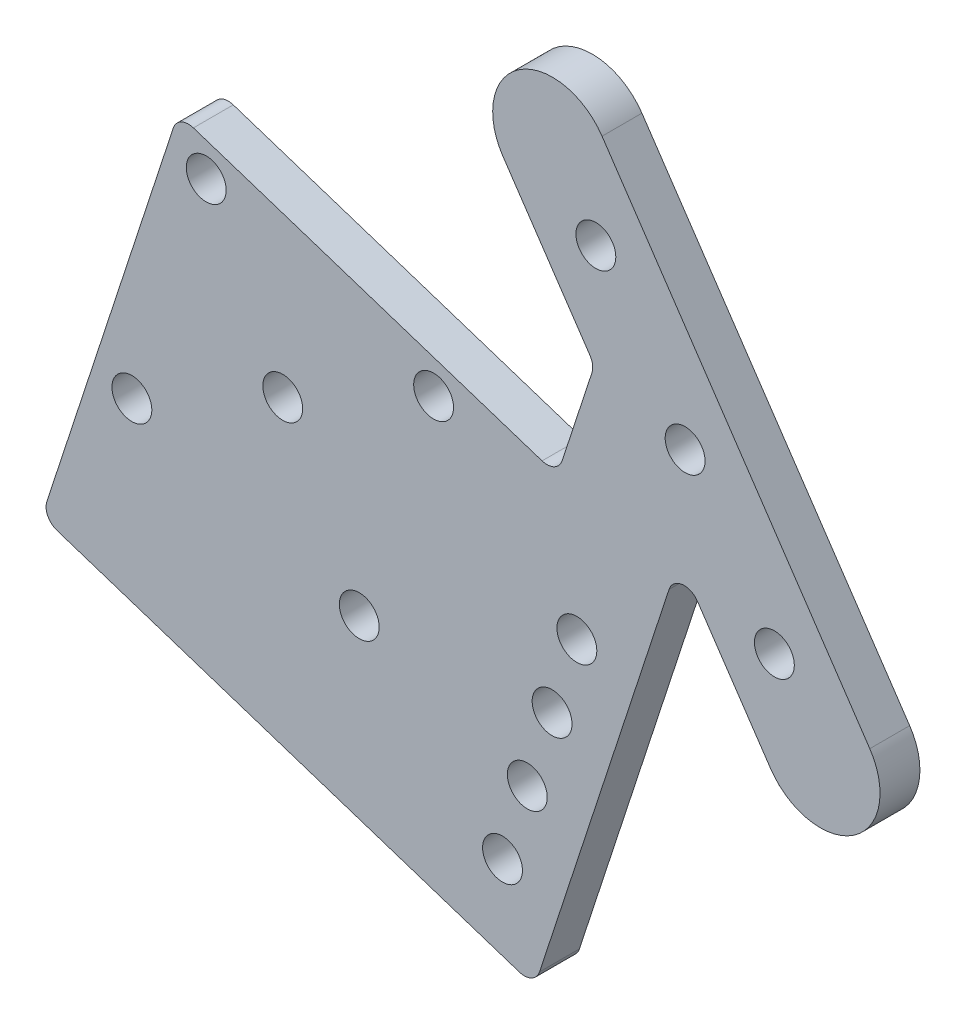
ISO-10303-21;
HEADER;
FILE_DESCRIPTION(('STEP AP214'),'2;1');
FILE_NAME('part.step','',(''),(''),'','','');
FILE_SCHEMA(('AUTOMOTIVE_DESIGN { 1 0 10303 214 1 1 1 1 }'));
ENDSEC;
DATA;
#1=APPLICATION_CONTEXT('core data for automotive mechanical design processes');
#2=APPLICATION_PROTOCOL_DEFINITION('international standard','automotive_design',2000,#1);
#3=PRODUCT_CONTEXT('',#1,'mechanical');
#4=PRODUCT('Part','Part','',(#3));
#5=PRODUCT_RELATED_PRODUCT_CATEGORY('part','',(#4));
#6=PRODUCT_DEFINITION_FORMATION('','',#4);
#7=PRODUCT_DEFINITION_CONTEXT('part definition',#1,'design');
#8=PRODUCT_DEFINITION('design','',#6,#7);
#9=PRODUCT_DEFINITION_SHAPE('','',#8);
#10=(LENGTH_UNIT() NAMED_UNIT(*) SI_UNIT(.MILLI.,.METRE.));
#11=(NAMED_UNIT(*) PLANE_ANGLE_UNIT() SI_UNIT($,.RADIAN.));
#12=(NAMED_UNIT(*) SI_UNIT($,.STERADIAN.) SOLID_ANGLE_UNIT());
#13=UNCERTAINTY_MEASURE_WITH_UNIT(LENGTH_MEASURE(1.E-05),#10,'distance_accuracy_value','');
#14=(GEOMETRIC_REPRESENTATION_CONTEXT(3) GLOBAL_UNCERTAINTY_ASSIGNED_CONTEXT((#13)) GLOBAL_UNIT_ASSIGNED_CONTEXT((#10,
#11,#12)) REPRESENTATION_CONTEXT('',''));
#15=CARTESIAN_POINT('',(0.,0.,0.));
#16=DIRECTION('',(0.,0.,1.));
#17=DIRECTION('',(1.,0.,0.));
#18=AXIS2_PLACEMENT_3D('',#15,#16,#17);
#19=CARTESIAN_POINT('',(-21.1234499247793,31.2849399165607,6.35));
#20=DIRECTION('',(0.,0.,1.));
#21=DIRECTION('',(1.,0.,0.));
#22=AXIS2_PLACEMENT_3D('',#19,#20,#21);
#23=PLANE('',#22);
#24=CARTESIAN_POINT('',(-76.2681819782983,-0.792959836781642,6.35));
#25=DIRECTION('',(0.,0.,-1.));
#26=DIRECTION('',(-1.,0.,0.));
#27=AXIS2_PLACEMENT_3D('',#24,#25,#26);
#28=CIRCLE('',#27,3.175);
#29=CARTESIAN_POINT('',(-79.4431819782983,-0.792959836781642,6.35));
#30=VERTEX_POINT('',#29);
#31=EDGE_CURVE('E266',#30,#30,#28,.T.);
#32=ORIENTED_EDGE('',*,*,#31,.T.);
#33=EDGE_LOOP('',(#32));
#34=FACE_BOUND('',#33,.T.);
#35=CARTESIAN_POINT('',(-40.0554564522475,-12.6356162100328,6.35));
#36=DIRECTION('',(0.,0.,-1.));
#37=DIRECTION('',(-1.,0.,0.));
#38=AXIS2_PLACEMENT_3D('',#35,#36,#37);
#39=CIRCLE('',#38,3.175);
#40=CARTESIAN_POINT('',(-43.2304564522475,-12.6356162100328,6.35));
#41=VERTEX_POINT('',#40);
#42=EDGE_CURVE('E652',#41,#41,#39,.T.);
#43=ORIENTED_EDGE('',*,*,#42,.T.);
#44=EDGE_LOOP('',(#43));
#45=FACE_BOUND('',#44,.T.);
#46=CARTESIAN_POINT('',(-51.8981128254986,-48.8483417360836,6.35));
#47=DIRECTION('',(0.,0.,-1.));
#48=DIRECTION('',(-1.,0.,0.));
#49=AXIS2_PLACEMENT_3D('',#46,#47,#48);
#50=CIRCLE('',#49,3.175);
#51=CARTESIAN_POINT('',(-55.0731128254986,-48.8483417360836,6.35));
#52=VERTEX_POINT('',#51);
#53=EDGE_CURVE('E657',#52,#52,#50,.T.);
#54=ORIENTED_EDGE('',*,*,#53,.T.);
#55=EDGE_LOOP('',(#54));
#56=FACE_BOUND('',#55,.T.);
#57=CARTESIAN_POINT('',(-88.1108383515494,-37.0056853628325,6.35));
#58=DIRECTION('',(0.,0.,-1.));
#59=DIRECTION('',(-1.,0.,0.));
#60=AXIS2_PLACEMENT_3D('',#57,#58,#59);
#61=CIRCLE('',#60,3.175);
#62=CARTESIAN_POINT('',(-91.2858383515494,-37.0056853628325,6.35));
#63=VERTEX_POINT('',#62);
#64=EDGE_CURVE('E668',#63,#63,#61,.T.);
#65=ORIENTED_EDGE('',*,*,#64,.T.);
#66=EDGE_LOOP('',(#65));
#67=FACE_BOUND('',#66,.T.);
#68=CARTESIAN_POINT('',(-64.0831474018985,-24.8206507864326,6.35));
#69=DIRECTION('',(0.,0.,-1.));
#70=DIRECTION('',(-1.,0.,0.));
#71=AXIS2_PLACEMENT_3D('',#68,#69,#70);
#72=CIRCLE('',#71,3.175);
#73=CARTESIAN_POINT('',(-67.2581474018985,-24.8206507864326,6.35));
#74=VERTEX_POINT('',#73);
#75=EDGE_CURVE('E673',#74,#74,#72,.T.);
#76=ORIENTED_EDGE('',*,*,#75,.T.);
#77=EDGE_LOOP('',(#76));
#78=FACE_BOUND('',#77,.T.);
#79=CARTESIAN_POINT('',(-21.1857717689851,-46.8665163582067,6.35));
#80=DIRECTION('',(0.,0.,1.));
#81=DIRECTION('',(1.,0.,0.));
#82=AXIS2_PLACEMENT_3D('',#79,#80,#81);
#83=CIRCLE('',#82,3.175);
#84=CARTESIAN_POINT('',(-18.0107717689851,-46.8665163582067,6.35));
#85=VERTEX_POINT('',#84);
#86=EDGE_CURVE('E274',#85,#85,#83,.T.);
#87=ORIENTED_EDGE('',*,*,#86,.F.);
#88=EDGE_LOOP('',(#87));
#89=FACE_BOUND('',#88,.T.);
#90=CARTESIAN_POINT('',(-25.1333238934022,-58.9374248668903,6.35));
#91=DIRECTION('',(0.,0.,1.));
#92=DIRECTION('',(1.,0.,0.));
#93=AXIS2_PLACEMENT_3D('',#90,#91,#92);
#94=CIRCLE('',#93,3.175);
#95=CARTESIAN_POINT('',(-21.9583238934022,-58.9374248668903,6.35));
#96=VERTEX_POINT('',#95);
#97=EDGE_CURVE('E286',#96,#96,#94,.T.);
#98=ORIENTED_EDGE('',*,*,#97,.F.);
#99=EDGE_LOOP('',(#98));
#100=FACE_BOUND('',#99,.T.);
#101=CARTESIAN_POINT('',(14.2134373211067,-21.0508479524928,6.35));
#102=DIRECTION('',(0.,0.,1.));
#103=DIRECTION('',(1.,0.,0.));
#104=AXIS2_PLACEMENT_3D('',#101,#102,#103);
#105=CIRCLE('',#104,3.17500000000001);
#106=CARTESIAN_POINT('',(17.3884373211067,-21.0508479524928,6.35));
#107=VERTEX_POINT('',#106);
#108=EDGE_CURVE('E298',#107,#107,#105,.T.);
#109=ORIENTED_EDGE('',*,*,#108,.F.);
#110=EDGE_LOOP('',(#109));
#111=FACE_BOUND('',#110,.T.);
#112=DIRECTION('',(0.950465236904222,-0.310830875938349,0.));
#113=VECTOR('',#112,1.);
#114=CARTESIAN_POINT('',(-23.9752467607235,-86.0399059775703,6.35));
#115=LINE('',#114,#113);
#116=CARTESIAN_POINT('',(-100.02197036543,-61.170327593743,6.35));
#117=VERTEX_POINT('',#116);
#118=CARTESIAN_POINT('',(-26.3894284624602,-85.2503955526869,6.35));
#119=VERTEX_POINT('',#118);
#120=EDGE_CURVE('E310',#117,#119,#115,.T.);
#121=ORIENTED_EDGE('',*,*,#120,.T.);
#122=CARTESIAN_POINT('',(-25.5999180375768,-82.8362138509502,6.35));
#123=DIRECTION('',(0.,0.,1.));
#124=DIRECTION('',(1.,0.,0.));
#125=AXIS2_PLACEMENT_3D('',#122,#123,#124);
#126=CIRCLE('',#125,2.54);
#127=CARTESIAN_POINT('',(-23.1857363358401,-83.6257242758336,6.35));
#128=VERTEX_POINT('',#127);
#129=EDGE_CURVE('E210',#119,#128,#126,.T.);
#130=ORIENTED_EDGE('',*,*,#129,.T.);
#131=DIRECTION('',(0.310830875938348,0.950465236904222,0.));
#132=VECTOR('',#131,1.);
#133=CARTESIAN_POINT('',(-0.945979197778359,-15.6205237850276,6.35));
#134=LINE('',#133,#132);
#135=CARTESIAN_POINT('',(-2.55983871036055,-20.5554175896599,6.35));
#136=VERTEX_POINT('',#135);
#137=EDGE_CURVE('E312',#128,#136,#134,.T.);
#138=ORIENTED_EDGE('',*,*,#137,.T.);
#139=CARTESIAN_POINT('',(-0.145657008623822,-21.3449280145433,6.35));
#140=DIRECTION('',(0.,0.,1.));
#141=DIRECTION('',(1.,0.,0.));
#142=AXIS2_PLACEMENT_3D('',#139,#140,#141);
#143=CIRCLE('',#142,2.54);
#144=CARTESIAN_POINT('',(1.95942778662546,-19.9235842824326,6.35));
#145=VERTEX_POINT('',#144);
#146=EDGE_CURVE('E227',#136,#145,#143,.F.);
#147=ORIENTED_EDGE('',*,*,#146,.T.);
#148=DIRECTION('',(0.559584146500264,-0.828773541436725,0.));
#149=VECTOR('',#148,1.);
#150=CARTESIAN_POINT('',(-0.945979197778359,-15.6205237850276,6.35));
#151=LINE('',#150,#149);
#152=CARTESIAN_POINT('',(13.622794056356,-37.1976429363328,6.35));
#153=VERTEX_POINT('',#152);
#154=EDGE_CURVE('E315',#145,#153,#151,.T.);
#155=ORIENTED_EDGE('',*,*,#154,.T.);
#156=CARTESIAN_POINT('',(21.5168620385408,-31.8676039409177,6.35));
#157=DIRECTION('',(0.,0.,1.));
#158=DIRECTION('',(1.,0.,0.));
#159=AXIS2_PLACEMENT_3D('',#156,#157,#158);
#160=CIRCLE('',#159,9.525);
#161=CARTESIAN_POINT('',(29.4109300207256,-26.5375649455027,6.35));
#162=VERTEX_POINT('',#161);
#163=EDGE_CURVE('E317',#153,#162,#160,.T.);
#164=ORIENTED_EDGE('',*,*,#163,.T.);
#165=DIRECTION('',(-0.559584146500264,0.828773541436725,0.));
#166=VECTOR('',#165,1.);
#167=CARTESIAN_POINT('',(-13.2293819425945,36.6149789119757,6.35));
#168=LINE('',#167,#166);
#169=CARTESIAN_POINT('',(-13.2293819425945,36.6149789119757,6.35));
#170=VERTEX_POINT('',#169);
#171=EDGE_CURVE('E166',#162,#170,#168,.T.);
#172=ORIENTED_EDGE('',*,*,#171,.T.);
#173=CARTESIAN_POINT('',(-21.1234499247793,31.2849399165607,6.35));
#174=DIRECTION('',(0.,0.,1.));
#175=DIRECTION('',(1.,0.,0.));
#176=AXIS2_PLACEMENT_3D('',#173,#174,#175);
#177=CIRCLE('',#176,9.52499999999999);
#178=CARTESIAN_POINT('',(-29.0175179069641,25.9549009211457,6.35));
#179=VERTEX_POINT('',#178);
#180=EDGE_CURVE('E160',#170,#179,#177,.T.);
#181=ORIENTED_EDGE('',*,*,#180,.T.);
#182=DIRECTION('',(0.559584146500264,-0.828773541436725,0.));
#183=VECTOR('',#182,1.);
#184=CARTESIAN_POINT('',(-29.0175179069641,25.9549009211457,6.35));
#185=LINE('',#184,#183);
#186=CARTESIAN_POINT('',(-15.1440751231063,5.4076027537338,6.35));
#187=VERTEX_POINT('',#186);
#188=EDGE_CURVE('E149',#179,#187,#185,.T.);
#189=ORIENTED_EDGE('',*,*,#188,.T.);
#190=CARTESIAN_POINT('',(-17.2491599183556,3.98625902162313,6.35));
#191=DIRECTION('',(0.,0.,1.));
#192=DIRECTION('',(1.,0.,0.));
#193=AXIS2_PLACEMENT_3D('',#190,#191,#192);
#194=CIRCLE('',#193,2.54);
#195=CARTESIAN_POINT('',(-14.8349782166188,3.19674859673972,6.35));
#196=VERTEX_POINT('',#195);
#197=EDGE_CURVE('E223',#187,#196,#194,.F.);
#198=ORIENTED_EDGE('',*,*,#197,.T.);
#199=DIRECTION('',(-0.310830875938349,-0.950465236904222,0.));
#200=VECTOR('',#199,1.);
#201=CARTESIAN_POINT('',(-14.4487446528297,4.37778176984056,6.35));
#202=LINE('',#201,#200);
#203=CARTESIAN_POINT('',(-19.5805624145718,-11.3143992914481,6.35));
#204=VERTEX_POINT('',#203);
#205=EDGE_CURVE('E159',#196,#204,#202,.T.);
#206=ORIENTED_EDGE('',*,*,#205,.T.);
#207=CARTESIAN_POINT('',(-21.9947441163086,-10.5248888665647,6.35));
#208=DIRECTION('',(0.,0.,1.));
#209=DIRECTION('',(1.,0.,0.));
#210=AXIS2_PLACEMENT_3D('',#207,#208,#209);
#211=CIRCLE('',#210,2.54);
#212=CARTESIAN_POINT('',(-22.784254541192,-12.9390705683014,6.35));
#213=VERTEX_POINT('',#212);
#214=EDGE_CURVE('E11',#204,#213,#211,.F.);
#215=ORIENTED_EDGE('',*,*,#214,.T.);
#216=DIRECTION('',(0.950465236904222,-0.310830875938349,0.));
#217=VECTOR('',#216,1.);
#218=CARTESIAN_POINT('',(-80.7246153828733,6.0091796289003,6.35));
#219=LINE('',#218,#217);
#220=CARTESIAN_POINT('',(-78.3104336811366,5.21966920401689,6.35));
#221=VERTEX_POINT('',#220);
#222=EDGE_CURVE('E251',#221,#213,#219,.T.);
#223=ORIENTED_EDGE('',*,*,#222,.F.);
#224=CARTESIAN_POINT('',(-79.09994410602,2.80548750228016,6.35));
#225=DIRECTION('',(0.,0.,1.));
#226=DIRECTION('',(1.,0.,0.));
#227=AXIS2_PLACEMENT_3D('',#224,#225,#226);
#228=CIRCLE('',#227,2.54);
#229=CARTESIAN_POINT('',(-81.5141258077568,3.59499792716355,6.35));
#230=VERTEX_POINT('',#229);
#231=EDGE_CURVE('E50',#221,#230,#228,.T.);
#232=ORIENTED_EDGE('',*,*,#231,.T.);
#233=DIRECTION('',(0.310830875938349,0.950465236904222,0.));
#234=VECTOR('',#233,1.);
#235=CARTESIAN_POINT('',(-102.436152067167,-60.3808171688596,6.35));
#236=LINE('',#235,#234);
#237=CARTESIAN_POINT('',(-101.646641642284,-57.9666354671229,6.35));
#238=VERTEX_POINT('',#237);
#239=EDGE_CURVE('E255',#238,#230,#236,.T.);
#240=ORIENTED_EDGE('',*,*,#239,.F.);
#241=CARTESIAN_POINT('',(-99.2324599405469,-58.7561458920063,6.35));
#242=DIRECTION('',(0.,0.,1.));
#243=DIRECTION('',(1.,0.,0.));
#244=AXIS2_PLACEMENT_3D('',#241,#242,#243);
#245=CIRCLE('',#244,2.54);
#246=EDGE_CURVE('E208',#238,#117,#245,.T.);
#247=ORIENTED_EDGE('',*,*,#246,.T.);
#248=EDGE_LOOP('',(#121,#130,#138,#147,#155,#164,#172,#181,#189,#198,#206,#215,#223,#232,#240,#247));
#249=FACE_BOUND('',#248,.T.);
#250=CARTESIAN_POINT('',(-14.2134373211067,21.0508479524928,6.35));
#251=DIRECTION('',(0.,0.,1.));
#252=DIRECTION('',(1.,0.,0.));
#253=AXIS2_PLACEMENT_3D('',#250,#251,#252);
#254=CIRCLE('',#253,3.175);
#255=CARTESIAN_POINT('',(-11.0384373211067,21.0508479524928,6.35));
#256=VERTEX_POINT('',#255);
#257=EDGE_CURVE('E304',#256,#256,#254,.T.);
#258=ORIENTED_EDGE('',*,*,#257,.F.);
#259=EDGE_LOOP('',(#258));
#260=FACE_BOUND('',#259,.T.);
#261=CARTESIAN_POINT('',(0.,0.,6.35));
#262=DIRECTION('',(0.,0.,1.));
#263=DIRECTION('',(1.,0.,0.));
#264=AXIS2_PLACEMENT_3D('',#261,#262,#263);
#265=CIRCLE('',#264,3.17499999999993);
#266=CARTESIAN_POINT('',(3.17499999999993,0.,6.35));
#267=VERTEX_POINT('',#266);
#268=EDGE_CURVE('E292',#267,#267,#265,.T.);
#269=ORIENTED_EDGE('',*,*,#268,.F.);
#270=EDGE_LOOP('',(#269));
#271=FACE_BOUND('',#270,.T.);
#272=CARTESIAN_POINT('',(-29.0808760178192,-71.0083333755739,6.35));
#273=DIRECTION('',(0.,0.,1.));
#274=DIRECTION('',(1.,0.,0.));
#275=AXIS2_PLACEMENT_3D('',#272,#273,#274);
#276=CIRCLE('',#275,3.175);
#277=CARTESIAN_POINT('',(-25.9058760178192,-71.0083333755739,6.35));
#278=VERTEX_POINT('',#277);
#279=EDGE_CURVE('E280',#278,#278,#276,.T.);
#280=ORIENTED_EDGE('',*,*,#279,.F.);
#281=EDGE_LOOP('',(#280));
#282=FACE_BOUND('',#281,.T.);
#283=CARTESIAN_POINT('',(-17.2382196445681,-34.7956078495231,6.35));
#284=DIRECTION('',(0.,0.,1.));
#285=DIRECTION('',(1.,0.,0.));
#286=AXIS2_PLACEMENT_3D('',#283,#284,#285);
#287=CIRCLE('',#286,3.175);
#288=CARTESIAN_POINT('',(-14.0632196445681,-34.7956078495231,6.35));
#289=VERTEX_POINT('',#288);
#290=EDGE_CURVE('E268',#289,#289,#287,.T.);
#291=ORIENTED_EDGE('',*,*,#290,.F.);
#292=EDGE_LOOP('',(#291));
#293=FACE_BOUND('',#292,.T.);
#294=ADVANCED_FACE('F35',(#34,#45,#56,#67,#78,#89,#100,#111,#249,#260,#271,#282,#293),#23,.T.);
#295=CARTESIAN_POINT('',(-21.1234499247793,31.2849399165607,0.));
#296=DIRECTION('',(0.,0.,1.));
#297=DIRECTION('',(1.,0.,0.));
#298=AXIS2_PLACEMENT_3D('',#295,#296,#297);
#299=PLANE('',#298);
#300=CARTESIAN_POINT('',(-76.2681819782983,-0.792959836781642,0.));
#301=DIRECTION('',(0.,0.,-1.));
#302=DIRECTION('',(-1.,0.,0.));
#303=AXIS2_PLACEMENT_3D('',#300,#301,#302);
#304=CIRCLE('',#303,3.175);
#305=CARTESIAN_POINT('',(-79.4431819782983,-0.792959836781642,0.));
#306=VERTEX_POINT('',#305);
#307=EDGE_CURVE('E659',#306,#306,#304,.T.);
#308=ORIENTED_EDGE('',*,*,#307,.F.);
#309=EDGE_LOOP('',(#308));
#310=FACE_BOUND('',#309,.T.);
#311=CARTESIAN_POINT('',(-40.0554564522475,-12.6356162100328,0.));
#312=DIRECTION('',(0.,0.,-1.));
#313=DIRECTION('',(-1.,0.,0.));
#314=AXIS2_PLACEMENT_3D('',#311,#312,#313);
#315=CIRCLE('',#314,3.175);
#316=CARTESIAN_POINT('',(-43.2304564522475,-12.6356162100328,0.));
#317=VERTEX_POINT('',#316);
#318=EDGE_CURVE('E655',#317,#317,#315,.T.);
#319=ORIENTED_EDGE('',*,*,#318,.F.);
#320=EDGE_LOOP('',(#319));
#321=FACE_BOUND('',#320,.T.);
#322=CARTESIAN_POINT('',(-51.8981128254986,-48.8483417360836,0.));
#323=DIRECTION('',(0.,0.,-1.));
#324=DIRECTION('',(-1.,0.,0.));
#325=AXIS2_PLACEMENT_3D('',#322,#323,#324);
#326=CIRCLE('',#325,3.175);
#327=CARTESIAN_POINT('',(-55.0731128254986,-48.8483417360836,0.));
#328=VERTEX_POINT('',#327);
#329=EDGE_CURVE('E662',#328,#328,#326,.T.);
#330=ORIENTED_EDGE('',*,*,#329,.F.);
#331=EDGE_LOOP('',(#330));
#332=FACE_BOUND('',#331,.T.);
#333=CARTESIAN_POINT('',(-88.1108383515494,-37.0056853628325,0.));
#334=DIRECTION('',(0.,0.,-1.));
#335=DIRECTION('',(-1.,0.,0.));
#336=AXIS2_PLACEMENT_3D('',#333,#334,#335);
#337=CIRCLE('',#336,3.175);
#338=CARTESIAN_POINT('',(-91.2858383515494,-37.0056853628325,0.));
#339=VERTEX_POINT('',#338);
#340=EDGE_CURVE('E671',#339,#339,#337,.T.);
#341=ORIENTED_EDGE('',*,*,#340,.F.);
#342=EDGE_LOOP('',(#341));
#343=FACE_BOUND('',#342,.T.);
#344=CARTESIAN_POINT('',(-64.0831474018985,-24.8206507864326,0.));
#345=DIRECTION('',(0.,0.,-1.));
#346=DIRECTION('',(-1.,0.,0.));
#347=AXIS2_PLACEMENT_3D('',#344,#345,#346);
#348=CIRCLE('',#347,3.175);
#349=CARTESIAN_POINT('',(-67.2581474018985,-24.8206507864326,0.));
#350=VERTEX_POINT('',#349);
#351=EDGE_CURVE('E263',#350,#350,#348,.T.);
#352=ORIENTED_EDGE('',*,*,#351,.F.);
#353=EDGE_LOOP('',(#352));
#354=FACE_BOUND('',#353,.T.);
#355=DIRECTION('',(0.310830875938348,0.950465236904222,0.));
#356=VECTOR('',#355,1.);
#357=CARTESIAN_POINT('',(-0.945979197778359,-15.6205237850276,0.));
#358=LINE('',#357,#356);
#359=CARTESIAN_POINT('',(-23.1857363358401,-83.6257242758336,0.));
#360=VERTEX_POINT('',#359);
#361=CARTESIAN_POINT('',(-2.55983871036055,-20.5554175896599,0.));
#362=VERTEX_POINT('',#361);
#363=EDGE_CURVE('E325',#360,#362,#358,.T.);
#364=ORIENTED_EDGE('',*,*,#363,.F.);
#365=CARTESIAN_POINT('',(-25.5999180375768,-82.8362138509502,0.));
#366=DIRECTION('',(0.,0.,1.));
#367=DIRECTION('',(1.,0.,0.));
#368=AXIS2_PLACEMENT_3D('',#365,#366,#367);
#369=CIRCLE('',#368,2.54);
#370=CARTESIAN_POINT('',(-26.3894284624602,-85.2503955526869,0.));
#371=VERTEX_POINT('',#370);
#372=EDGE_CURVE('E200',#360,#371,#369,.F.);
#373=ORIENTED_EDGE('',*,*,#372,.T.);
#374=DIRECTION('',(0.950465236904222,-0.310830875938349,0.));
#375=VECTOR('',#374,1.);
#376=CARTESIAN_POINT('',(-23.9752467607235,-86.0399059775703,0.));
#377=LINE('',#376,#375);
#378=CARTESIAN_POINT('',(-100.02197036543,-61.170327593743,0.));
#379=VERTEX_POINT('',#378);
#380=EDGE_CURVE('E246',#379,#371,#377,.T.);
#381=ORIENTED_EDGE('',*,*,#380,.F.);
#382=CARTESIAN_POINT('',(-99.2324599405469,-58.7561458920063,0.));
#383=DIRECTION('',(0.,0.,1.));
#384=DIRECTION('',(1.,0.,0.));
#385=AXIS2_PLACEMENT_3D('',#382,#383,#384);
#386=CIRCLE('',#385,2.54);
#387=CARTESIAN_POINT('',(-101.646641642284,-57.9666354671229,0.));
#388=VERTEX_POINT('',#387);
#389=EDGE_CURVE('E198',#379,#388,#386,.F.);
#390=ORIENTED_EDGE('',*,*,#389,.T.);
#391=DIRECTION('',(0.310830875938349,0.950465236904222,0.));
#392=VECTOR('',#391,1.);
#393=CARTESIAN_POINT('',(-102.436152067167,-60.3808171688596,0.));
#394=LINE('',#393,#392);
#395=CARTESIAN_POINT('',(-81.5141258077568,3.59499792716355,0.));
#396=VERTEX_POINT('',#395);
#397=EDGE_CURVE('E256',#388,#396,#394,.T.);
#398=ORIENTED_EDGE('',*,*,#397,.T.);
#399=CARTESIAN_POINT('',(-79.09994410602,2.80548750228016,0.));
#400=DIRECTION('',(0.,0.,1.));
#401=DIRECTION('',(1.,0.,0.));
#402=AXIS2_PLACEMENT_3D('',#399,#400,#401);
#403=CIRCLE('',#402,2.54);
#404=CARTESIAN_POINT('',(-78.3104336811366,5.21966920401689,0.));
#405=VERTEX_POINT('',#404);
#406=EDGE_CURVE('E196',#396,#405,#403,.F.);
#407=ORIENTED_EDGE('',*,*,#406,.T.);
#408=DIRECTION('',(0.950465236904222,-0.310830875938349,0.));
#409=VECTOR('',#408,1.);
#410=CARTESIAN_POINT('',(-80.7246153828733,6.0091796289003,0.));
#411=LINE('',#410,#409);
#412=CARTESIAN_POINT('',(-22.784254541192,-12.9390705683014,0.));
#413=VERTEX_POINT('',#412);
#414=EDGE_CURVE('E237',#405,#413,#411,.T.);
#415=ORIENTED_EDGE('',*,*,#414,.T.);
#416=CARTESIAN_POINT('',(-21.9947441163086,-10.5248888665647,0.));
#417=DIRECTION('',(0.,0.,1.));
#418=DIRECTION('',(1.,0.,0.));
#419=AXIS2_PLACEMENT_3D('',#416,#417,#418);
#420=CIRCLE('',#419,2.54);
#421=CARTESIAN_POINT('',(-19.5805624145718,-11.3143992914481,0.));
#422=VERTEX_POINT('',#421);
#423=EDGE_CURVE('E43',#413,#422,#420,.T.);
#424=ORIENTED_EDGE('',*,*,#423,.T.);
#425=DIRECTION('',(-0.310830875938349,-0.950465236904222,0.));
#426=VECTOR('',#425,1.);
#427=CARTESIAN_POINT('',(-14.4487446528297,4.37778176984056,0.));
#428=LINE('',#427,#426);
#429=CARTESIAN_POINT('',(-14.8349782166188,3.19674859673972,0.));
#430=VERTEX_POINT('',#429);
#431=EDGE_CURVE('E235',#430,#422,#428,.T.);
#432=ORIENTED_EDGE('',*,*,#431,.F.);
#433=CARTESIAN_POINT('',(-17.2491599183556,3.98625902162313,0.));
#434=DIRECTION('',(0.,0.,1.));
#435=DIRECTION('',(1.,0.,0.));
#436=AXIS2_PLACEMENT_3D('',#433,#434,#435);
#437=CIRCLE('',#436,2.54);
#438=CARTESIAN_POINT('',(-15.1440751231063,5.4076027537338,0.));
#439=VERTEX_POINT('',#438);
#440=EDGE_CURVE('E221',#430,#439,#437,.T.);
#441=ORIENTED_EDGE('',*,*,#440,.T.);
#442=DIRECTION('',(0.559584146500264,-0.828773541436725,0.));
#443=VECTOR('',#442,1.);
#444=CARTESIAN_POINT('',(-29.0175179069641,25.9549009211457,0.));
#445=LINE('',#444,#443);
#446=CARTESIAN_POINT('',(-29.0175179069641,25.9549009211457,0.));
#447=VERTEX_POINT('',#446);
#448=EDGE_CURVE('E247',#447,#439,#445,.T.);
#449=ORIENTED_EDGE('',*,*,#448,.F.);
#450=CARTESIAN_POINT('',(-21.1234499247793,31.2849399165607,0.));
#451=DIRECTION('',(0.,0.,1.));
#452=DIRECTION('',(1.,0.,0.));
#453=AXIS2_PLACEMENT_3D('',#450,#451,#452);
#454=CIRCLE('',#453,9.52499999999999);
#455=CARTESIAN_POINT('',(-13.2293819425945,36.6149789119757,0.));
#456=VERTEX_POINT('',#455);
#457=EDGE_CURVE('E174',#456,#447,#454,.T.);
#458=ORIENTED_EDGE('',*,*,#457,.F.);
#459=DIRECTION('',(-0.559584146500264,0.828773541436725,0.));
#460=VECTOR('',#459,1.);
#461=CARTESIAN_POINT('',(-13.2293819425945,36.6149789119757,0.));
#462=LINE('',#461,#460);
#463=CARTESIAN_POINT('',(29.4109300207256,-26.5375649455027,0.));
#464=VERTEX_POINT('',#463);
#465=EDGE_CURVE('E170',#464,#456,#462,.T.);
#466=ORIENTED_EDGE('',*,*,#465,.F.);
#467=CARTESIAN_POINT('',(21.5168620385408,-31.8676039409177,0.));
#468=DIRECTION('',(0.,0.,1.));
#469=DIRECTION('',(1.,0.,0.));
#470=AXIS2_PLACEMENT_3D('',#467,#468,#469);
#471=CIRCLE('',#470,9.525);
#472=CARTESIAN_POINT('',(13.622794056356,-37.1976429363328,0.));
#473=VERTEX_POINT('',#472);
#474=EDGE_CURVE('E330',#473,#464,#471,.T.);
#475=ORIENTED_EDGE('',*,*,#474,.F.);
#476=DIRECTION('',(0.559584146500264,-0.828773541436725,0.));
#477=VECTOR('',#476,1.);
#478=CARTESIAN_POINT('',(-0.945979197778359,-15.6205237850276,0.));
#479=LINE('',#478,#477);
#480=CARTESIAN_POINT('',(1.95942778662546,-19.9235842824326,0.));
#481=VERTEX_POINT('',#480);
#482=EDGE_CURVE('E328',#481,#473,#479,.T.);
#483=ORIENTED_EDGE('',*,*,#482,.F.);
#484=CARTESIAN_POINT('',(-0.145657008623822,-21.3449280145433,0.));
#485=DIRECTION('',(0.,0.,1.));
#486=DIRECTION('',(1.,0.,0.));
#487=AXIS2_PLACEMENT_3D('',#484,#485,#486);
#488=CIRCLE('',#487,2.54);
#489=EDGE_CURVE('E225',#481,#362,#488,.T.);
#490=ORIENTED_EDGE('',*,*,#489,.T.);
#491=EDGE_LOOP('',(#364,#373,#381,#390,#398,#407,#415,#424,#432,#441,#449,#458,#466,#475,#483,#490));
#492=FACE_BOUND('',#491,.T.);
#493=CARTESIAN_POINT('',(-14.2134373211067,21.0508479524928,0.));
#494=DIRECTION('',(0.,0.,1.));
#495=DIRECTION('',(1.,0.,0.));
#496=AXIS2_PLACEMENT_3D('',#493,#494,#495);
#497=CIRCLE('',#496,3.175);
#498=CARTESIAN_POINT('',(-11.0384373211067,21.0508479524928,0.));
#499=VERTEX_POINT('',#498);
#500=EDGE_CURVE('E301',#499,#499,#497,.T.);
#501=ORIENTED_EDGE('',*,*,#500,.T.);
#502=EDGE_LOOP('',(#501));
#503=FACE_BOUND('',#502,.T.);
#504=CARTESIAN_POINT('',(14.2134373211067,-21.0508479524928,0.));
#505=DIRECTION('',(0.,0.,1.));
#506=DIRECTION('',(1.,0.,0.));
#507=AXIS2_PLACEMENT_3D('',#504,#505,#506);
#508=CIRCLE('',#507,3.17500000000001);
#509=CARTESIAN_POINT('',(17.3884373211067,-21.0508479524928,0.));
#510=VERTEX_POINT('',#509);
#511=EDGE_CURVE('E295',#510,#510,#508,.T.);
#512=ORIENTED_EDGE('',*,*,#511,.T.);
#513=EDGE_LOOP('',(#512));
#514=FACE_BOUND('',#513,.T.);
#515=CARTESIAN_POINT('',(0.,0.,0.));
#516=DIRECTION('',(0.,0.,1.));
#517=DIRECTION('',(1.,0.,0.));
#518=AXIS2_PLACEMENT_3D('',#515,#516,#517);
#519=CIRCLE('',#518,3.17499999999993);
#520=CARTESIAN_POINT('',(3.17499999999993,0.,0.));
#521=VERTEX_POINT('',#520);
#522=EDGE_CURVE('E289',#521,#521,#519,.T.);
#523=ORIENTED_EDGE('',*,*,#522,.T.);
#524=EDGE_LOOP('',(#523));
#525=FACE_BOUND('',#524,.T.);
#526=CARTESIAN_POINT('',(-25.1333238934022,-58.9374248668903,0.));
#527=DIRECTION('',(0.,0.,1.));
#528=DIRECTION('',(1.,0.,0.));
#529=AXIS2_PLACEMENT_3D('',#526,#527,#528);
#530=CIRCLE('',#529,3.175);
#531=CARTESIAN_POINT('',(-21.9583238934022,-58.9374248668903,0.));
#532=VERTEX_POINT('',#531);
#533=EDGE_CURVE('E283',#532,#532,#530,.T.);
#534=ORIENTED_EDGE('',*,*,#533,.T.);
#535=EDGE_LOOP('',(#534));
#536=FACE_BOUND('',#535,.T.);
#537=CARTESIAN_POINT('',(-29.0808760178192,-71.0083333755739,0.));
#538=DIRECTION('',(0.,0.,1.));
#539=DIRECTION('',(1.,0.,0.));
#540=AXIS2_PLACEMENT_3D('',#537,#538,#539);
#541=CIRCLE('',#540,3.175);
#542=CARTESIAN_POINT('',(-25.9058760178192,-71.0083333755739,0.));
#543=VERTEX_POINT('',#542);
#544=EDGE_CURVE('E277',#543,#543,#541,.T.);
#545=ORIENTED_EDGE('',*,*,#544,.T.);
#546=EDGE_LOOP('',(#545));
#547=FACE_BOUND('',#546,.T.);
#548=CARTESIAN_POINT('',(-21.1857717689851,-46.8665163582067,0.));
#549=DIRECTION('',(0.,0.,1.));
#550=DIRECTION('',(1.,0.,0.));
#551=AXIS2_PLACEMENT_3D('',#548,#549,#550);
#552=CIRCLE('',#551,3.175);
#553=CARTESIAN_POINT('',(-18.0107717689851,-46.8665163582067,0.));
#554=VERTEX_POINT('',#553);
#555=EDGE_CURVE('E271',#554,#554,#552,.T.);
#556=ORIENTED_EDGE('',*,*,#555,.T.);
#557=EDGE_LOOP('',(#556));
#558=FACE_BOUND('',#557,.T.);
#559=CARTESIAN_POINT('',(-17.2382196445681,-34.7956078495231,0.));
#560=DIRECTION('',(0.,0.,1.));
#561=DIRECTION('',(1.,0.,0.));
#562=AXIS2_PLACEMENT_3D('',#559,#560,#561);
#563=CIRCLE('',#562,3.175);
#564=CARTESIAN_POINT('',(-14.0632196445681,-34.7956078495231,0.));
#565=VERTEX_POINT('',#564);
#566=EDGE_CURVE('E258',#565,#565,#563,.T.);
#567=ORIENTED_EDGE('',*,*,#566,.T.);
#568=EDGE_LOOP('',(#567));
#569=FACE_BOUND('',#568,.T.);
#570=ADVANCED_FACE('F233',(#310,#321,#332,#343,#354,#492,#503,#514,#525,#536,#547,#558,#569),
#299,.F.);
#571=CARTESIAN_POINT('',(-21.1234499247793,31.2849399165607,6.35));
#572=DIRECTION('',(0.,0.,-1.));
#573=DIRECTION('',(-1.,0.,0.));
#574=AXIS2_PLACEMENT_3D('',#571,#572,#573);
#575=CYLINDRICAL_SURFACE('',#574,9.52499999999999);
#576=ORIENTED_EDGE('',*,*,#457,.T.);
#577=DIRECTION('',(0.,0.,-1.));
#578=VECTOR('',#577,1.);
#579=CARTESIAN_POINT('',(-29.0175179069641,25.9549009211457,6.35));
#580=LINE('',#579,#578);
#581=EDGE_CURVE('E154',#179,#447,#580,.T.);
#582=ORIENTED_EDGE('',*,*,#581,.F.);
#583=ORIENTED_EDGE('',*,*,#180,.F.);
#584=DIRECTION('',(0.,0.,-1.));
#585=VECTOR('',#584,1.);
#586=CARTESIAN_POINT('',(-13.2293819425945,36.6149789119757,6.35));
#587=LINE('',#586,#585);
#588=EDGE_CURVE('E320',#170,#456,#587,.T.);
#589=ORIENTED_EDGE('',*,*,#588,.T.);
#590=EDGE_LOOP('',(#576,#582,#583,#589));
#591=FACE_BOUND('',#590,.T.);
#592=ADVANCED_FACE('F172',(#591),#575,.T.);
#593=CARTESIAN_POINT('',(-29.0175179069641,25.9549009211457,6.35));
#594=DIRECTION('',(0.828773541436725,0.559584146500264,0.));
#595=DIRECTION('',(-0.559584146500264,0.828773541436725,0.));
#596=AXIS2_PLACEMENT_3D('',#593,#594,#595);
#597=PLANE('',#596);
#598=ORIENTED_EDGE('',*,*,#448,.T.);
#599=DIRECTION('',(0.,0.,-1.));
#600=VECTOR('',#599,1.);
#601=CARTESIAN_POINT('',(-15.1440751231063,5.4076027537338,6.35));
#602=LINE('',#601,#600);
#603=EDGE_CURVE('E157',#439,#187,#602,.F.);
#604=ORIENTED_EDGE('',*,*,#603,.T.);
#605=ORIENTED_EDGE('',*,*,#188,.F.);
#606=ORIENTED_EDGE('',*,*,#581,.T.);
#607=EDGE_LOOP('',(#598,#604,#605,#606));
#608=FACE_BOUND('',#607,.T.);
#609=ADVANCED_FACE('F152',(#608),#597,.F.);
#610=CARTESIAN_POINT('',(-14.4487446528297,4.37778176984056,6.35));
#611=DIRECTION('',(0.950465236904222,-0.310830875938349,0.));
#612=DIRECTION('',(0.310830875938349,0.950465236904222,0.));
#613=AXIS2_PLACEMENT_3D('',#610,#611,#612);
#614=PLANE('',#613);
#615=ORIENTED_EDGE('',*,*,#205,.F.);
#616=DIRECTION('',(0.,0.,-1.));
#617=VECTOR('',#616,1.);
#618=CARTESIAN_POINT('',(-14.8349782166188,3.19674859673972,0.));
#619=LINE('',#618,#617);
#620=EDGE_CURVE('E178',#196,#430,#619,.T.);
#621=ORIENTED_EDGE('',*,*,#620,.T.);
#622=ORIENTED_EDGE('',*,*,#431,.T.);
#623=DIRECTION('',(0.,0.,-1.));
#624=VECTOR('',#623,1.);
#625=CARTESIAN_POINT('',(-19.5805624145718,-11.3143992914481,6.35));
#626=LINE('',#625,#624);
#627=EDGE_CURVE('E175',#422,#204,#626,.F.);
#628=ORIENTED_EDGE('',*,*,#627,.T.);
#629=EDGE_LOOP('',(#615,#621,#622,#628));
#630=FACE_BOUND('',#629,.T.);
#631=ADVANCED_FACE('F243',(#630),#614,.F.);
#632=CARTESIAN_POINT('',(-23.9752467607235,-86.0399059775703,6.35));
#633=DIRECTION('',(0.310830875938349,0.950465236904222,0.));
#634=DIRECTION('',(-0.950465236904222,0.310830875938349,0.));
#635=AXIS2_PLACEMENT_3D('',#632,#633,#634);
#636=PLANE('',#635);
#637=ORIENTED_EDGE('',*,*,#380,.T.);
#638=DIRECTION('',(0.,0.,-1.));
#639=VECTOR('',#638,1.);
#640=CARTESIAN_POINT('',(-26.3894284624602,-85.2503955526869,6.35));
#641=LINE('',#640,#639);
#642=EDGE_CURVE('E205',#371,#119,#641,.F.);
#643=ORIENTED_EDGE('',*,*,#642,.T.);
#644=ORIENTED_EDGE('',*,*,#120,.F.);
#645=DIRECTION('',(0.,0.,-1.));
#646=VECTOR('',#645,1.);
#647=CARTESIAN_POINT('',(-100.02197036543,-61.170327593743,0.));
#648=LINE('',#647,#646);
#649=EDGE_CURVE('E202',#117,#379,#648,.T.);
#650=ORIENTED_EDGE('',*,*,#649,.T.);
#651=EDGE_LOOP('',(#637,#643,#644,#650));
#652=FACE_BOUND('',#651,.T.);
#653=ADVANCED_FACE('F385',(#652),#636,.F.);
#654=CARTESIAN_POINT('',(-0.945979197778359,-15.6205237850276,6.35));
#655=DIRECTION('',(-0.950465236904222,0.310830875938348,0.));
#656=DIRECTION('',(-0.310830875938348,-0.950465236904222,0.));
#657=AXIS2_PLACEMENT_3D('',#654,#655,#656);
#658=PLANE('',#657);
#659=ORIENTED_EDGE('',*,*,#363,.T.);
#660=DIRECTION('',(0.,0.,-1.));
#661=VECTOR('',#660,1.);
#662=CARTESIAN_POINT('',(-2.55983871036055,-20.5554175896599,6.35));
#663=LINE('',#662,#661);
#664=EDGE_CURVE('E194',#362,#136,#663,.F.);
#665=ORIENTED_EDGE('',*,*,#664,.T.);
#666=ORIENTED_EDGE('',*,*,#137,.F.);
#667=DIRECTION('',(0.,0.,-1.));
#668=VECTOR('',#667,1.);
#669=CARTESIAN_POINT('',(-23.1857363358401,-83.6257242758336,6.35));
#670=LINE('',#669,#668);
#671=EDGE_CURVE('E191',#128,#360,#670,.T.);
#672=ORIENTED_EDGE('',*,*,#671,.T.);
#673=EDGE_LOOP('',(#659,#665,#666,#672));
#674=FACE_BOUND('',#673,.T.);
#675=ADVANCED_FACE('F381',(#674),#658,.F.);
#676=CARTESIAN_POINT('',(-0.945979197778359,-15.6205237850276,6.35));
#677=DIRECTION('',(0.828773541436725,0.559584146500264,0.));
#678=DIRECTION('',(-0.559584146500264,0.828773541436725,0.));
#679=AXIS2_PLACEMENT_3D('',#676,#677,#678);
#680=PLANE('',#679);
#681=ORIENTED_EDGE('',*,*,#154,.F.);
#682=DIRECTION('',(0.,0.,-1.));
#683=VECTOR('',#682,1.);
#684=CARTESIAN_POINT('',(1.95942778662546,-19.9235842824326,0.));
#685=LINE('',#684,#683);
#686=EDGE_CURVE('E188',#145,#481,#685,.T.);
#687=ORIENTED_EDGE('',*,*,#686,.T.);
#688=ORIENTED_EDGE('',*,*,#482,.T.);
#689=DIRECTION('',(0.,0.,-1.));
#690=VECTOR('',#689,1.);
#691=CARTESIAN_POINT('',(13.622794056356,-37.1976429363328,6.35));
#692=LINE('',#691,#690);
#693=EDGE_CURVE('E176',#153,#473,#692,.T.);
#694=ORIENTED_EDGE('',*,*,#693,.F.);
#695=EDGE_LOOP('',(#681,#687,#688,#694));
#696=FACE_BOUND('',#695,.T.);
#697=ADVANCED_FACE('F378',(#696),#680,.F.);
#698=CARTESIAN_POINT('',(21.5168620385408,-31.8676039409177,6.35));
#699=DIRECTION('',(0.,0.,-1.));
#700=DIRECTION('',(-1.,0.,0.));
#701=AXIS2_PLACEMENT_3D('',#698,#699,#700);
#702=CYLINDRICAL_SURFACE('',#701,9.525);
#703=ORIENTED_EDGE('',*,*,#474,.T.);
#704=DIRECTION('',(0.,0.,-1.));
#705=VECTOR('',#704,1.);
#706=CARTESIAN_POINT('',(29.4109300207256,-26.5375649455027,6.35));
#707=LINE('',#706,#705);
#708=EDGE_CURVE('E181',#162,#464,#707,.T.);
#709=ORIENTED_EDGE('',*,*,#708,.F.);
#710=ORIENTED_EDGE('',*,*,#163,.F.);
#711=ORIENTED_EDGE('',*,*,#693,.T.);
#712=EDGE_LOOP('',(#703,#709,#710,#711));
#713=FACE_BOUND('',#712,.T.);
#714=ADVANCED_FACE('F375',(#713),#702,.T.);
#715=CARTESIAN_POINT('',(-13.2293819425945,36.6149789119757,6.35));
#716=DIRECTION('',(-0.828773541436725,-0.559584146500264,0.));
#717=DIRECTION('',(0.559584146500264,-0.828773541436725,0.));
#718=AXIS2_PLACEMENT_3D('',#715,#716,#717);
#719=PLANE('',#718);
#720=ORIENTED_EDGE('',*,*,#465,.T.);
#721=ORIENTED_EDGE('',*,*,#588,.F.);
#722=ORIENTED_EDGE('',*,*,#171,.F.);
#723=ORIENTED_EDGE('',*,*,#708,.T.);
#724=EDGE_LOOP('',(#720,#721,#722,#723));
#725=FACE_BOUND('',#724,.T.);
#726=ADVANCED_FACE('F337',(#725),#719,.F.);
#727=CARTESIAN_POINT('',(-14.2134373211067,21.0508479524928,6.35));
#728=DIRECTION('',(0.,0.,-1.));
#729=DIRECTION('',(-1.,0.,0.));
#730=AXIS2_PLACEMENT_3D('',#727,#728,#729);
#731=CYLINDRICAL_SURFACE('',#730,3.175);
#732=ORIENTED_EDGE('',*,*,#257,.T.);
#733=EDGE_LOOP('',(#732));
#734=FACE_BOUND('',#733,.T.);
#735=ORIENTED_EDGE('',*,*,#500,.F.);
#736=EDGE_LOOP('',(#735));
#737=FACE_BOUND('',#736,.T.);
#738=ADVANCED_FACE('F370',(#734,#737),#731,.F.);
#739=CARTESIAN_POINT('',(14.2134373211067,-21.0508479524928,6.35));
#740=DIRECTION('',(0.,0.,-1.));
#741=DIRECTION('',(-1.,0.,0.));
#742=AXIS2_PLACEMENT_3D('',#739,#740,#741);
#743=CYLINDRICAL_SURFACE('',#742,3.17500000000001);
#744=ORIENTED_EDGE('',*,*,#108,.T.);
#745=EDGE_LOOP('',(#744));
#746=FACE_BOUND('',#745,.T.);
#747=ORIENTED_EDGE('',*,*,#511,.F.);
#748=EDGE_LOOP('',(#747));
#749=FACE_BOUND('',#748,.T.);
#750=ADVANCED_FACE('F433',(#746,#749),#743,.F.);
#751=CARTESIAN_POINT('',(0.,0.,6.35));
#752=DIRECTION('',(0.,0.,-1.));
#753=DIRECTION('',(-1.,0.,0.));
#754=AXIS2_PLACEMENT_3D('',#751,#752,#753);
#755=CYLINDRICAL_SURFACE('',#754,3.17499999999993);
#756=ORIENTED_EDGE('',*,*,#268,.T.);
#757=EDGE_LOOP('',(#756));
#758=FACE_BOUND('',#757,.T.);
#759=ORIENTED_EDGE('',*,*,#522,.F.);
#760=EDGE_LOOP('',(#759));
#761=FACE_BOUND('',#760,.T.);
#762=ADVANCED_FACE('F440',(#758,#761),#755,.F.);
#763=CARTESIAN_POINT('',(-25.1333238934022,-58.9374248668903,6.35));
#764=DIRECTION('',(0.,0.,-1.));
#765=DIRECTION('',(-1.,0.,0.));
#766=AXIS2_PLACEMENT_3D('',#763,#764,#765);
#767=CYLINDRICAL_SURFACE('',#766,3.175);
#768=ORIENTED_EDGE('',*,*,#97,.T.);
#769=EDGE_LOOP('',(#768));
#770=FACE_BOUND('',#769,.T.);
#771=ORIENTED_EDGE('',*,*,#533,.F.);
#772=EDGE_LOOP('',(#771));
#773=FACE_BOUND('',#772,.T.);
#774=ADVANCED_FACE('F447',(#770,#773),#767,.F.);
#775=CARTESIAN_POINT('',(-29.0808760178192,-71.0083333755739,6.35));
#776=DIRECTION('',(0.,0.,-1.));
#777=DIRECTION('',(-1.,0.,0.));
#778=AXIS2_PLACEMENT_3D('',#775,#776,#777);
#779=CYLINDRICAL_SURFACE('',#778,3.175);
#780=ORIENTED_EDGE('',*,*,#279,.T.);
#781=EDGE_LOOP('',(#780));
#782=FACE_BOUND('',#781,.T.);
#783=ORIENTED_EDGE('',*,*,#544,.F.);
#784=EDGE_LOOP('',(#783));
#785=FACE_BOUND('',#784,.T.);
#786=ADVANCED_FACE('F455',(#782,#785),#779,.F.);
#787=CARTESIAN_POINT('',(-21.1857717689851,-46.8665163582067,6.35));
#788=DIRECTION('',(0.,0.,-1.));
#789=DIRECTION('',(-1.,0.,0.));
#790=AXIS2_PLACEMENT_3D('',#787,#788,#789);
#791=CYLINDRICAL_SURFACE('',#790,3.175);
#792=ORIENTED_EDGE('',*,*,#86,.T.);
#793=EDGE_LOOP('',(#792));
#794=FACE_BOUND('',#793,.T.);
#795=ORIENTED_EDGE('',*,*,#555,.F.);
#796=EDGE_LOOP('',(#795));
#797=FACE_BOUND('',#796,.T.);
#798=ADVANCED_FACE('F463',(#794,#797),#791,.F.);
#799=CARTESIAN_POINT('',(-17.2382196445681,-34.7956078495231,6.35));
#800=DIRECTION('',(0.,0.,-1.));
#801=DIRECTION('',(-1.,0.,0.));
#802=AXIS2_PLACEMENT_3D('',#799,#800,#801);
#803=CYLINDRICAL_SURFACE('',#802,3.175);
#804=ORIENTED_EDGE('',*,*,#290,.T.);
#805=EDGE_LOOP('',(#804));
#806=FACE_BOUND('',#805,.T.);
#807=ORIENTED_EDGE('',*,*,#566,.F.);
#808=EDGE_LOOP('',(#807));
#809=FACE_BOUND('',#808,.T.);
#810=ADVANCED_FACE('F471',(#806,#809),#803,.F.);
#811=CARTESIAN_POINT('',(-80.7246153828733,6.0091796289003,6.35));
#812=DIRECTION('',(0.310830875938349,0.950465236904222,0.));
#813=DIRECTION('',(-0.950465236904222,0.310830875938349,0.));
#814=AXIS2_PLACEMENT_3D('',#811,#812,#813);
#815=PLANE('',#814);
#816=ORIENTED_EDGE('',*,*,#414,.F.);
#817=DIRECTION('',(0.,0.,-1.));
#818=VECTOR('',#817,1.);
#819=CARTESIAN_POINT('',(-78.3104336811366,5.21966920401689,6.35));
#820=LINE('',#819,#818);
#821=EDGE_CURVE('E219',#405,#221,#820,.F.);
#822=ORIENTED_EDGE('',*,*,#821,.T.);
#823=ORIENTED_EDGE('',*,*,#222,.T.);
#824=DIRECTION('',(0.,0.,-1.));
#825=VECTOR('',#824,1.);
#826=CARTESIAN_POINT('',(-22.784254541192,-12.9390705683014,6.35));
#827=LINE('',#826,#825);
#828=EDGE_CURVE('E216',#213,#413,#827,.T.);
#829=ORIENTED_EDGE('',*,*,#828,.T.);
#830=EDGE_LOOP('',(#816,#822,#823,#829));
#831=FACE_BOUND('',#830,.T.);
#832=ADVANCED_FACE('F253',(#831),#815,.T.);
#833=CARTESIAN_POINT('',(-102.436152067167,-60.3808171688596,6.35));
#834=DIRECTION('',(-0.950465236904222,0.310830875938349,0.));
#835=DIRECTION('',(-0.310830875938349,-0.950465236904222,0.));
#836=AXIS2_PLACEMENT_3D('',#833,#834,#835);
#837=PLANE('',#836);
#838=ORIENTED_EDGE('',*,*,#397,.F.);
#839=DIRECTION('',(0.,0.,-1.));
#840=VECTOR('',#839,1.);
#841=CARTESIAN_POINT('',(-101.646641642284,-57.9666354671229,6.35));
#842=LINE('',#841,#840);
#843=EDGE_CURVE('E57',#388,#238,#842,.F.);
#844=ORIENTED_EDGE('',*,*,#843,.T.);
#845=ORIENTED_EDGE('',*,*,#239,.T.);
#846=DIRECTION('',(0.,0.,-1.));
#847=VECTOR('',#846,1.);
#848=CARTESIAN_POINT('',(-81.5141258077568,3.59499792716355,6.35));
#849=LINE('',#848,#847);
#850=EDGE_CURVE('E212',#230,#396,#849,.T.);
#851=ORIENTED_EDGE('',*,*,#850,.T.);
#852=EDGE_LOOP('',(#838,#844,#845,#851));
#853=FACE_BOUND('',#852,.T.);
#854=ADVANCED_FACE('F486',(#853),#837,.T.);
#855=CARTESIAN_POINT('',(-64.0831474018985,-24.8206507864326,6.35));
#856=DIRECTION('',(0.,0.,-1.));
#857=DIRECTION('',(-1.,0.,0.));
#858=AXIS2_PLACEMENT_3D('',#855,#856,#857);
#859=CYLINDRICAL_SURFACE('',#858,3.175);
#860=ORIENTED_EDGE('',*,*,#75,.F.);
#861=EDGE_LOOP('',(#860));
#862=FACE_BOUND('',#861,.T.);
#863=ORIENTED_EDGE('',*,*,#351,.T.);
#864=EDGE_LOOP('',(#863));
#865=FACE_BOUND('',#864,.T.);
#866=ADVANCED_FACE('F493',(#862,#865),#859,.F.);
#867=CARTESIAN_POINT('',(-88.1108383515494,-37.0056853628325,6.35));
#868=DIRECTION('',(0.,0.,-1.));
#869=DIRECTION('',(-1.,0.,0.));
#870=AXIS2_PLACEMENT_3D('',#867,#868,#869);
#871=CYLINDRICAL_SURFACE('',#870,3.175);
#872=ORIENTED_EDGE('',*,*,#64,.F.);
#873=EDGE_LOOP('',(#872));
#874=FACE_BOUND('',#873,.T.);
#875=ORIENTED_EDGE('',*,*,#340,.T.);
#876=EDGE_LOOP('',(#875));
#877=FACE_BOUND('',#876,.T.);
#878=ADVANCED_FACE('F499',(#874,#877),#871,.F.);
#879=CARTESIAN_POINT('',(-51.8981128254986,-48.8483417360836,6.35));
#880=DIRECTION('',(0.,0.,-1.));
#881=DIRECTION('',(-1.,0.,0.));
#882=AXIS2_PLACEMENT_3D('',#879,#880,#881);
#883=CYLINDRICAL_SURFACE('',#882,3.175);
#884=ORIENTED_EDGE('',*,*,#53,.F.);
#885=EDGE_LOOP('',(#884));
#886=FACE_BOUND('',#885,.T.);
#887=ORIENTED_EDGE('',*,*,#329,.T.);
#888=EDGE_LOOP('',(#887));
#889=FACE_BOUND('',#888,.T.);
#890=ADVANCED_FACE('F507',(#886,#889),#883,.F.);
#891=CARTESIAN_POINT('',(-40.0554564522475,-12.6356162100328,6.35));
#892=DIRECTION('',(0.,0.,-1.));
#893=DIRECTION('',(-1.,0.,0.));
#894=AXIS2_PLACEMENT_3D('',#891,#892,#893);
#895=CYLINDRICAL_SURFACE('',#894,3.175);
#896=ORIENTED_EDGE('',*,*,#42,.F.);
#897=EDGE_LOOP('',(#896));
#898=FACE_BOUND('',#897,.T.);
#899=ORIENTED_EDGE('',*,*,#318,.T.);
#900=EDGE_LOOP('',(#899));
#901=FACE_BOUND('',#900,.T.);
#902=ADVANCED_FACE('F355',(#898,#901),#895,.F.);
#903=CARTESIAN_POINT('',(-76.2681819782983,-0.792959836781642,6.35));
#904=DIRECTION('',(0.,0.,-1.));
#905=DIRECTION('',(-1.,0.,0.));
#906=AXIS2_PLACEMENT_3D('',#903,#904,#905);
#907=CYLINDRICAL_SURFACE('',#906,3.175);
#908=ORIENTED_EDGE('',*,*,#31,.F.);
#909=EDGE_LOOP('',(#908));
#910=FACE_BOUND('',#909,.T.);
#911=ORIENTED_EDGE('',*,*,#307,.T.);
#912=EDGE_LOOP('',(#911));
#913=FACE_BOUND('',#912,.T.);
#914=ADVANCED_FACE('F346',(#910,#913),#907,.F.);
#915=CARTESIAN_POINT('',(-17.2491599183556,3.98625902162313,6.35));
#916=DIRECTION('',(0.,0.,1.));
#917=DIRECTION('',(1.,0.,0.));
#918=AXIS2_PLACEMENT_3D('',#915,#916,#917);
#919=CYLINDRICAL_SURFACE('',#918,2.54);
#920=ORIENTED_EDGE('',*,*,#197,.F.);
#921=ORIENTED_EDGE('',*,*,#603,.F.);
#922=ORIENTED_EDGE('',*,*,#440,.F.);
#923=ORIENTED_EDGE('',*,*,#620,.F.);
#924=EDGE_LOOP('',(#920,#921,#922,#923));
#925=FACE_BOUND('',#924,.T.);
#926=ADVANCED_FACE('F343',(#925),#919,.F.);
#927=CARTESIAN_POINT('',(-0.145657008623822,-21.3449280145433,6.35));
#928=DIRECTION('',(0.,0.,1.));
#929=DIRECTION('',(1.,0.,0.));
#930=AXIS2_PLACEMENT_3D('',#927,#928,#929);
#931=CYLINDRICAL_SURFACE('',#930,2.54);
#932=ORIENTED_EDGE('',*,*,#146,.F.);
#933=ORIENTED_EDGE('',*,*,#664,.F.);
#934=ORIENTED_EDGE('',*,*,#489,.F.);
#935=ORIENTED_EDGE('',*,*,#686,.F.);
#936=EDGE_LOOP('',(#932,#933,#934,#935));
#937=FACE_BOUND('',#936,.T.);
#938=ADVANCED_FACE('F345',(#937),#931,.F.);
#939=CARTESIAN_POINT('',(-25.5999180375768,-82.8362138509502,6.35));
#940=DIRECTION('',(0.,0.,-1.));
#941=DIRECTION('',(-1.,0.,0.));
#942=AXIS2_PLACEMENT_3D('',#939,#940,#941);
#943=CYLINDRICAL_SURFACE('',#942,2.54);
#944=ORIENTED_EDGE('',*,*,#129,.F.);
#945=ORIENTED_EDGE('',*,*,#642,.F.);
#946=ORIENTED_EDGE('',*,*,#372,.F.);
#947=ORIENTED_EDGE('',*,*,#671,.F.);
#948=EDGE_LOOP('',(#944,#945,#946,#947));
#949=FACE_BOUND('',#948,.T.);
#950=ADVANCED_FACE('F352',(#949),#943,.T.);
#951=CARTESIAN_POINT('',(-99.2324599405469,-58.7561458920063,6.35));
#952=DIRECTION('',(0.,0.,1.));
#953=DIRECTION('',(1.,0.,0.));
#954=AXIS2_PLACEMENT_3D('',#951,#952,#953);
#955=CYLINDRICAL_SURFACE('',#954,2.54);
#956=ORIENTED_EDGE('',*,*,#246,.F.);
#957=ORIENTED_EDGE('',*,*,#843,.F.);
#958=ORIENTED_EDGE('',*,*,#389,.F.);
#959=ORIENTED_EDGE('',*,*,#649,.F.);
#960=EDGE_LOOP('',(#956,#957,#958,#959));
#961=FACE_BOUND('',#960,.T.);
#962=ADVANCED_FACE('F605',(#961),#955,.T.);
#963=CARTESIAN_POINT('',(-79.09994410602,2.80548750228016,6.35));
#964=DIRECTION('',(0.,0.,-1.));
#965=DIRECTION('',(-1.,0.,0.));
#966=AXIS2_PLACEMENT_3D('',#963,#964,#965);
#967=CYLINDRICAL_SURFACE('',#966,2.54);
#968=ORIENTED_EDGE('',*,*,#231,.F.);
#969=ORIENTED_EDGE('',*,*,#821,.F.);
#970=ORIENTED_EDGE('',*,*,#406,.F.);
#971=ORIENTED_EDGE('',*,*,#850,.F.);
#972=EDGE_LOOP('',(#968,#969,#970,#971));
#973=FACE_BOUND('',#972,.T.);
#974=ADVANCED_FACE('F614',(#973),#967,.T.);
#975=CARTESIAN_POINT('',(-21.9947441163086,-10.5248888665647,6.35));
#976=DIRECTION('',(0.,0.,-1.));
#977=DIRECTION('',(-1.,0.,0.));
#978=AXIS2_PLACEMENT_3D('',#975,#976,#977);
#979=CYLINDRICAL_SURFACE('',#978,2.54);
#980=ORIENTED_EDGE('',*,*,#214,.F.);
#981=ORIENTED_EDGE('',*,*,#627,.F.);
#982=ORIENTED_EDGE('',*,*,#423,.F.);
#983=ORIENTED_EDGE('',*,*,#828,.F.);
#984=EDGE_LOOP('',(#980,#981,#982,#983));
#985=FACE_BOUND('',#984,.T.);
#986=ADVANCED_FACE('F37',(#985),#979,.F.);
#987=CLOSED_SHELL('',(#294,#570,#592,#609,#631,#653,#675,#697,#714,#726,#738,#750,#762,#774,
#786,#798,#810,#832,#854,#866,#878,#890,#902,#914,#926,#938,#950,#962,#974,#986));
#988=MANIFOLD_SOLID_BREP('B2',#987);
#989=ADVANCED_BREP_SHAPE_REPRESENTATION('',(#18,#988),#14);
#990=SHAPE_DEFINITION_REPRESENTATION(#9,#989);
ENDSEC;
END-ISO-10303-21;
